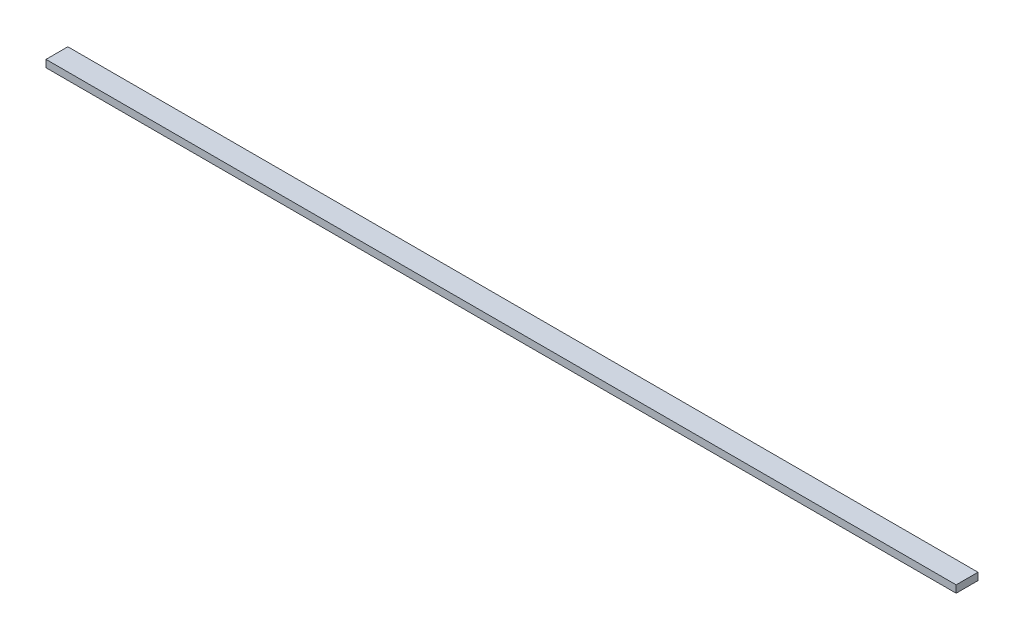
ISO-10303-21;
HEADER;
FILE_DESCRIPTION(('STEP AP214'),'2;1');
FILE_NAME('part.step','',(''),(''),'','','');
FILE_SCHEMA(('AUTOMOTIVE_DESIGN { 1 0 10303 214 1 1 1 1 }'));
ENDSEC;
DATA;
#1=APPLICATION_CONTEXT('core data for automotive mechanical design processes');
#2=APPLICATION_PROTOCOL_DEFINITION('international standard','automotive_design',2000,#1);
#3=PRODUCT_CONTEXT('',#1,'mechanical');
#4=PRODUCT('Part','Part','',(#3));
#5=PRODUCT_RELATED_PRODUCT_CATEGORY('part','',(#4));
#6=PRODUCT_DEFINITION_FORMATION('','',#4);
#7=PRODUCT_DEFINITION_CONTEXT('part definition',#1,'design');
#8=PRODUCT_DEFINITION('design','',#6,#7);
#9=PRODUCT_DEFINITION_SHAPE('','',#8);
#10=(LENGTH_UNIT() NAMED_UNIT(*) SI_UNIT(.MILLI.,.METRE.));
#11=(NAMED_UNIT(*) PLANE_ANGLE_UNIT() SI_UNIT($,.RADIAN.));
#12=(NAMED_UNIT(*) SI_UNIT($,.STERADIAN.) SOLID_ANGLE_UNIT());
#13=UNCERTAINTY_MEASURE_WITH_UNIT(LENGTH_MEASURE(1.E-05),#10,'distance_accuracy_value','');
#14=(GEOMETRIC_REPRESENTATION_CONTEXT(3) GLOBAL_UNCERTAINTY_ASSIGNED_CONTEXT((#13)) GLOBAL_UNIT_ASSIGNED_CONTEXT((#10,
#11,#12)) REPRESENTATION_CONTEXT('',''));
#15=CARTESIAN_POINT('',(0.,0.,0.));
#16=DIRECTION('',(0.,0.,1.));
#17=DIRECTION('',(1.,0.,0.));
#18=AXIS2_PLACEMENT_3D('',#15,#16,#17);
#19=CARTESIAN_POINT('',(-625.,10.,-15.));
#20=DIRECTION('',(1.,0.,0.));
#21=DIRECTION('',(0.,0.,-1.));
#22=AXIS2_PLACEMENT_3D('',#19,#20,#21);
#23=PLANE('',#22);
#24=DIRECTION('',(0.,0.,1.));
#25=VECTOR('',#24,1.);
#26=CARTESIAN_POINT('',(-625.,0.,-15.));
#27=LINE('',#26,#25);
#28=CARTESIAN_POINT('',(-625.,0.,-15.));
#29=VERTEX_POINT('',#28);
#30=CARTESIAN_POINT('',(-625.,0.,15.));
#31=VERTEX_POINT('',#30);
#32=EDGE_CURVE('E95',#29,#31,#27,.T.);
#33=ORIENTED_EDGE('',*,*,#32,.T.);
#34=DIRECTION('',(0.,-1.,0.));
#35=VECTOR('',#34,1.);
#36=CARTESIAN_POINT('',(-625.,10.,15.));
#37=LINE('',#36,#35);
#38=CARTESIAN_POINT('',(-625.,10.,15.));
#39=VERTEX_POINT('',#38);
#40=EDGE_CURVE('E11',#39,#31,#37,.T.);
#41=ORIENTED_EDGE('',*,*,#40,.F.);
#42=DIRECTION('',(0.,0.,1.));
#43=VECTOR('',#42,1.);
#44=CARTESIAN_POINT('',(-625.,10.,-15.));
#45=LINE('',#44,#43);
#46=CARTESIAN_POINT('',(-625.,10.,-15.));
#47=VERTEX_POINT('',#46);
#48=EDGE_CURVE('E83',#47,#39,#45,.T.);
#49=ORIENTED_EDGE('',*,*,#48,.F.);
#50=DIRECTION('',(0.,-1.,0.));
#51=VECTOR('',#50,1.);
#52=CARTESIAN_POINT('',(-625.,10.,-15.));
#53=LINE('',#52,#51);
#54=EDGE_CURVE('E91',#47,#29,#53,.T.);
#55=ORIENTED_EDGE('',*,*,#54,.T.);
#56=EDGE_LOOP('',(#33,#41,#49,#55));
#57=FACE_BOUND('',#56,.T.);
#58=ADVANCED_FACE('F32',(#57),#23,.F.);
#59=CARTESIAN_POINT('',(-625.,10.,15.));
#60=DIRECTION('',(0.,0.,-1.));
#61=DIRECTION('',(-1.,0.,0.));
#62=AXIS2_PLACEMENT_3D('',#59,#60,#61);
#63=PLANE('',#62);
#64=DIRECTION('',(1.,0.,0.));
#65=VECTOR('',#64,1.);
#66=CARTESIAN_POINT('',(-625.,0.,15.));
#67=LINE('',#66,#65);
#68=CARTESIAN_POINT('',(625.,0.,15.));
#69=VERTEX_POINT('',#68);
#70=EDGE_CURVE('E87',#31,#69,#67,.T.);
#71=ORIENTED_EDGE('',*,*,#70,.T.);
#72=DIRECTION('',(0.,-1.,0.));
#73=VECTOR('',#72,1.);
#74=CARTESIAN_POINT('',(625.,10.,15.));
#75=LINE('',#74,#73);
#76=CARTESIAN_POINT('',(625.,10.,15.));
#77=VERTEX_POINT('',#76);
#78=EDGE_CURVE('E40',#77,#69,#75,.T.);
#79=ORIENTED_EDGE('',*,*,#78,.F.);
#80=DIRECTION('',(1.,0.,0.));
#81=VECTOR('',#80,1.);
#82=CARTESIAN_POINT('',(-625.,10.,15.));
#83=LINE('',#82,#81);
#84=EDGE_CURVE('E78',#39,#77,#83,.T.);
#85=ORIENTED_EDGE('',*,*,#84,.F.);
#86=ORIENTED_EDGE('',*,*,#40,.T.);
#87=EDGE_LOOP('',(#71,#79,#85,#86));
#88=FACE_BOUND('',#87,.T.);
#89=ADVANCED_FACE('F86',(#88),#63,.F.);
#90=CARTESIAN_POINT('',(625.,10.,-15.));
#91=DIRECTION('',(-1.,0.,0.));
#92=DIRECTION('',(0.,0.,1.));
#93=AXIS2_PLACEMENT_3D('',#90,#91,#92);
#94=PLANE('',#93);
#95=DIRECTION('',(0.,0.,-1.));
#96=VECTOR('',#95,1.);
#97=CARTESIAN_POINT('',(625.,0.,-15.));
#98=LINE('',#97,#96);
#99=CARTESIAN_POINT('',(625.,0.,-15.));
#100=VERTEX_POINT('',#99);
#101=EDGE_CURVE('E65',#69,#100,#98,.T.);
#102=ORIENTED_EDGE('',*,*,#101,.T.);
#103=DIRECTION('',(0.,-1.,0.));
#104=VECTOR('',#103,1.);
#105=CARTESIAN_POINT('',(625.,10.,-15.));
#106=LINE('',#105,#104);
#107=CARTESIAN_POINT('',(625.,10.,-15.));
#108=VERTEX_POINT('',#107);
#109=EDGE_CURVE('E88',#108,#100,#106,.T.);
#110=ORIENTED_EDGE('',*,*,#109,.F.);
#111=DIRECTION('',(0.,0.,-1.));
#112=VECTOR('',#111,1.);
#113=CARTESIAN_POINT('',(625.,10.,-15.));
#114=LINE('',#113,#112);
#115=EDGE_CURVE('E81',#77,#108,#114,.T.);
#116=ORIENTED_EDGE('',*,*,#115,.F.);
#117=ORIENTED_EDGE('',*,*,#78,.T.);
#118=EDGE_LOOP('',(#102,#110,#116,#117));
#119=FACE_BOUND('',#118,.T.);
#120=ADVANCED_FACE('F89',(#119),#94,.F.);
#121=CARTESIAN_POINT('',(-625.,10.,-15.));
#122=DIRECTION('',(0.,0.,1.));
#123=DIRECTION('',(1.,0.,0.));
#124=AXIS2_PLACEMENT_3D('',#121,#122,#123);
#125=PLANE('',#124);
#126=DIRECTION('',(-1.,0.,0.));
#127=VECTOR('',#126,1.);
#128=CARTESIAN_POINT('',(-625.,0.,-15.));
#129=LINE('',#128,#127);
#130=EDGE_CURVE('E71',#100,#29,#129,.T.);
#131=ORIENTED_EDGE('',*,*,#130,.T.);
#132=ORIENTED_EDGE('',*,*,#54,.F.);
#133=DIRECTION('',(-1.,0.,0.));
#134=VECTOR('',#133,1.);
#135=CARTESIAN_POINT('',(-625.,10.,-15.));
#136=LINE('',#135,#134);
#137=EDGE_CURVE('E48',#108,#47,#136,.T.);
#138=ORIENTED_EDGE('',*,*,#137,.F.);
#139=ORIENTED_EDGE('',*,*,#109,.T.);
#140=EDGE_LOOP('',(#131,#132,#138,#139));
#141=FACE_BOUND('',#140,.T.);
#142=ADVANCED_FACE('F102',(#141),#125,.F.);
#143=CARTESIAN_POINT('',(0.,10.,0.));
#144=DIRECTION('',(0.,1.,0.));
#145=DIRECTION('',(0.,0.,1.));
#146=AXIS2_PLACEMENT_3D('',#143,#144,#145);
#147=PLANE('',#146);
#148=ORIENTED_EDGE('',*,*,#48,.T.);
#149=ORIENTED_EDGE('',*,*,#84,.T.);
#150=ORIENTED_EDGE('',*,*,#115,.T.);
#151=ORIENTED_EDGE('',*,*,#137,.T.);
#152=EDGE_LOOP('',(#148,#149,#150,#151));
#153=FACE_BOUND('',#152,.T.);
#154=ADVANCED_FACE('F79',(#153),#147,.T.);
#155=CARTESIAN_POINT('',(0.,0.,0.));
#156=DIRECTION('',(0.,1.,0.));
#157=DIRECTION('',(0.,0.,1.));
#158=AXIS2_PLACEMENT_3D('',#155,#156,#157);
#159=PLANE('',#158);
#160=ORIENTED_EDGE('',*,*,#32,.F.);
#161=ORIENTED_EDGE('',*,*,#130,.F.);
#162=ORIENTED_EDGE('',*,*,#101,.F.);
#163=ORIENTED_EDGE('',*,*,#70,.F.);
#164=EDGE_LOOP('',(#160,#161,#162,#163));
#165=FACE_BOUND('',#164,.T.);
#166=ADVANCED_FACE('F105',(#165),#159,.F.);
#167=CLOSED_SHELL('',(#58,#89,#120,#142,#154,#166));
#168=MANIFOLD_SOLID_BREP('B2',#167);
#169=ADVANCED_BREP_SHAPE_REPRESENTATION('',(#18,#168),#14);
#170=SHAPE_DEFINITION_REPRESENTATION(#9,#169);
ENDSEC;
END-ISO-10303-21;
